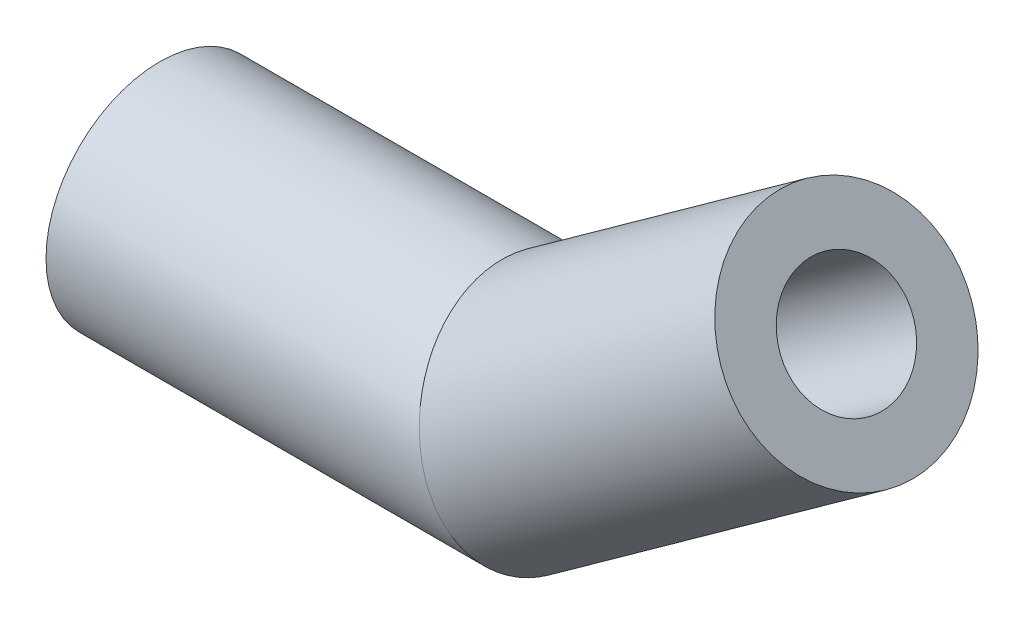
ISO-10303-21;
HEADER;
FILE_DESCRIPTION(('STEP AP214'),'2;1');
FILE_NAME('part.step','',(''),(''),'','','');
FILE_SCHEMA(('AUTOMOTIVE_DESIGN { 1 0 10303 214 1 1 1 1 }'));
ENDSEC;
DATA;
#1=APPLICATION_CONTEXT('core data for automotive mechanical design processes');
#2=APPLICATION_PROTOCOL_DEFINITION('international standard','automotive_design',2000,#1);
#3=PRODUCT_CONTEXT('',#1,'mechanical');
#4=PRODUCT('Part','Part','',(#3));
#5=PRODUCT_RELATED_PRODUCT_CATEGORY('part','',(#4));
#6=PRODUCT_DEFINITION_FORMATION('','',#4);
#7=PRODUCT_DEFINITION_CONTEXT('part definition',#1,'design');
#8=PRODUCT_DEFINITION('design','',#6,#7);
#9=PRODUCT_DEFINITION_SHAPE('','',#8);
#10=(LENGTH_UNIT() NAMED_UNIT(*) SI_UNIT(.MILLI.,.METRE.));
#11=(NAMED_UNIT(*) PLANE_ANGLE_UNIT() SI_UNIT($,.RADIAN.));
#12=(NAMED_UNIT(*) SI_UNIT($,.STERADIAN.) SOLID_ANGLE_UNIT());
#13=UNCERTAINTY_MEASURE_WITH_UNIT(LENGTH_MEASURE(1.E-05),#10,'distance_accuracy_value','');
#14=(GEOMETRIC_REPRESENTATION_CONTEXT(3) GLOBAL_UNCERTAINTY_ASSIGNED_CONTEXT((#13)) GLOBAL_UNIT_ASSIGNED_CONTEXT((#10,
#11,#12)) REPRESENTATION_CONTEXT('',''));
#15=CARTESIAN_POINT('',(0.,0.,0.));
#16=DIRECTION('',(0.,0.,1.));
#17=DIRECTION('',(1.,0.,0.));
#18=AXIS2_PLACEMENT_3D('',#15,#16,#17);
#19=CARTESIAN_POINT('',(18.1198166736899,5.83682937781013,0.));
#20=DIRECTION('',(-0.81198166736899,-0.583682937781013,0.));
#21=DIRECTION('',(0.583682937781013,-0.81198166736899,0.));
#22=AXIS2_PLACEMENT_3D('',#19,#20,#21);
#23=PLANE('',#22);
#24=CARTESIAN_POINT('',(18.1198166736899,5.83682937781013,0.));
#25=DIRECTION('',(0.811981667368991,0.583682937781013,0.));
#26=DIRECTION('',(0.,0.,-1.));
#27=AXIS2_PLACEMENT_3D('',#24,#25,#26);
#28=CIRCLE('',#27,1.6);
#29=CARTESIAN_POINT('',(18.1198166736899,5.83682937781013,-1.6));
#30=VERTEX_POINT('',#29);
#31=EDGE_CURVE('E65',#30,#30,#28,.T.);
#32=ORIENTED_EDGE('',*,*,#31,.F.);
#33=EDGE_LOOP('',(#32));
#34=FACE_BOUND('',#33,.T.);
#35=CARTESIAN_POINT('',(18.1198166736899,5.83682937781013,0.));
#36=DIRECTION('',(-0.81198166736899,-0.583682937781013,0.));
#37=DIRECTION('',(0.583682937781013,-0.81198166736899,0.));
#38=AXIS2_PLACEMENT_3D('',#35,#36,#37);
#39=CIRCLE('',#38,3.);
#40=CARTESIAN_POINT('',(19.8708654870329,3.40088437570316,0.));
#41=VERTEX_POINT('',#40);
#42=EDGE_CURVE('E48',#41,#41,#39,.T.);
#43=ORIENTED_EDGE('',*,*,#42,.F.);
#44=EDGE_LOOP('',(#43));
#45=FACE_BOUND('',#44,.T.);
#46=ADVANCED_FACE('F45',(#34,#45),#23,.F.);
#47=CARTESIAN_POINT('',(0.,0.,0.));
#48=DIRECTION('',(-1.,0.,0.));
#49=DIRECTION('',(0.,-1.,0.));
#50=AXIS2_PLACEMENT_3D('',#47,#48,#49);
#51=PLANE('',#50);
#52=CARTESIAN_POINT('',(0.,0.,0.));
#53=DIRECTION('',(1.,0.,0.));
#54=DIRECTION('',(0.,0.,-1.));
#55=AXIS2_PLACEMENT_3D('',#52,#53,#54);
#56=CIRCLE('',#55,1.6);
#57=CARTESIAN_POINT('',(0.,0.,-1.6));
#58=VERTEX_POINT('',#57);
#59=EDGE_CURVE('E58',#58,#58,#56,.T.);
#60=ORIENTED_EDGE('',*,*,#59,.T.);
#61=EDGE_LOOP('',(#60));
#62=FACE_BOUND('',#61,.T.);
#63=CARTESIAN_POINT('',(0.,0.,0.));
#64=DIRECTION('',(-1.,0.,0.));
#65=DIRECTION('',(0.,-1.,0.));
#66=AXIS2_PLACEMENT_3D('',#63,#64,#65);
#67=CIRCLE('',#66,3.);
#68=CARTESIAN_POINT('',(0.,-3.,0.));
#69=VERTEX_POINT('',#68);
#70=EDGE_CURVE('E52',#69,#69,#67,.T.);
#71=ORIENTED_EDGE('',*,*,#70,.T.);
#72=EDGE_LOOP('',(#71));
#73=FACE_BOUND('',#72,.T.);
#74=ADVANCED_FACE('F82',(#62,#73),#51,.T.);
#75=CARTESIAN_POINT('',(9.0556576211674,-0.678828791460432,0.));
#76=DIRECTION('',(0.811981667368991,0.583682937781013,0.));
#77=DIRECTION('',(-0.583682937781013,0.811981667368991,0.));
#78=AXIS2_PLACEMENT_3D('',#75,#76,#77);
#79=CYLINDRICAL_SURFACE('',#78,3.);
#80=CARTESIAN_POINT('',(10.,0.,0.));
#81=DIRECTION('',(0.951835507682129,0.306609142583036,0.));
#82=DIRECTION('',(0.306609142583036,-0.951835507682129,0.));
#83=AXIS2_PLACEMENT_3D('',#80,#81,#82);
#84=ELLIPSE('',#83,3.1518050921482,3.);
#85=CARTESIAN_POINT('',(10.9663722568924,-3.,0.));
#86=VERTEX_POINT('',#85);
#87=EDGE_CURVE('E11',#86,#86,#84,.T.);
#88=ORIENTED_EDGE('',*,*,#87,.T.);
#89=EDGE_LOOP('',(#88));
#90=FACE_BOUND('',#89,.T.);
#91=ORIENTED_EDGE('',*,*,#42,.T.);
#92=EDGE_LOOP('',(#91));
#93=FACE_BOUND('',#92,.T.);
#94=ADVANCED_FACE('F87',(#90,#93),#79,.T.);
#95=CARTESIAN_POINT('',(0.,0.,0.));
#96=DIRECTION('',(1.,0.,0.));
#97=DIRECTION('',(0.,0.,-1.));
#98=AXIS2_PLACEMENT_3D('',#95,#96,#97);
#99=CYLINDRICAL_SURFACE('',#98,3.);
#100=ORIENTED_EDGE('',*,*,#70,.F.);
#101=EDGE_LOOP('',(#100));
#102=FACE_BOUND('',#101,.T.);
#103=ORIENTED_EDGE('',*,*,#87,.F.);
#104=EDGE_LOOP('',(#103));
#105=FACE_BOUND('',#104,.T.);
#106=ADVANCED_FACE('F89',(#102,#105),#99,.T.);
#107=CARTESIAN_POINT('',(7.,0.,0.));
#108=DIRECTION('',(-1.,0.,0.));
#109=DIRECTION('',(0.,0.,1.));
#110=AXIS2_PLACEMENT_3D('',#107,#108,#109);
#111=CYLINDRICAL_SURFACE('',#110,1.6);
#112=CARTESIAN_POINT('',(7.,0.,0.));
#113=DIRECTION('',(1.,0.,0.));
#114=DIRECTION('',(0.,0.,-1.));
#115=AXIS2_PLACEMENT_3D('',#112,#113,#114);
#116=CIRCLE('',#115,1.6);
#117=CARTESIAN_POINT('',(7.,0.,-1.6));
#118=VERTEX_POINT('',#117);
#119=EDGE_CURVE('E61',#118,#118,#116,.T.);
#120=ORIENTED_EDGE('',*,*,#119,.T.);
#121=EDGE_LOOP('',(#120));
#122=FACE_BOUND('',#121,.T.);
#123=ORIENTED_EDGE('',*,*,#59,.F.);
#124=EDGE_LOOP('',(#123));
#125=FACE_BOUND('',#124,.T.);
#126=ADVANCED_FACE('F83',(#122,#125),#111,.F.);
#127=CARTESIAN_POINT('',(7.,0.,0.));
#128=DIRECTION('',(1.,0.,0.));
#129=DIRECTION('',(0.,0.,-1.));
#130=AXIS2_PLACEMENT_3D('',#127,#128,#129);
#131=PLANE('',#130);
#132=ORIENTED_EDGE('',*,*,#119,.F.);
#133=EDGE_LOOP('',(#132));
#134=FACE_BOUND('',#133,.T.);
#135=ADVANCED_FACE('F76',(#134),#131,.F.);
#136=CARTESIAN_POINT('',(12.435945002107,1.75104881334304,0.));
#137=DIRECTION('',(0.811981667368991,0.583682937781013,0.));
#138=DIRECTION('',(-0.583682937781013,0.811981667368991,0.));
#139=AXIS2_PLACEMENT_3D('',#136,#137,#138);
#140=CYLINDRICAL_SURFACE('',#139,1.6);
#141=CARTESIAN_POINT('',(12.435945002107,1.75104881334304,0.));
#142=DIRECTION('',(0.811981667368991,0.583682937781013,0.));
#143=DIRECTION('',(0.,0.,-1.));
#144=AXIS2_PLACEMENT_3D('',#141,#142,#143);
#145=CIRCLE('',#144,1.6);
#146=CARTESIAN_POINT('',(12.435945002107,1.75104881334304,-1.6));
#147=VERTEX_POINT('',#146);
#148=EDGE_CURVE('E62',#147,#147,#145,.T.);
#149=ORIENTED_EDGE('',*,*,#148,.F.);
#150=EDGE_LOOP('',(#149));
#151=FACE_BOUND('',#150,.T.);
#152=ORIENTED_EDGE('',*,*,#31,.T.);
#153=EDGE_LOOP('',(#152));
#154=FACE_BOUND('',#153,.T.);
#155=ADVANCED_FACE('F73',(#151,#154),#140,.F.);
#156=CARTESIAN_POINT('',(12.435945002107,1.75104881334304,0.));
#157=DIRECTION('',(-0.811981667368991,-0.583682937781013,0.));
#158=DIRECTION('',(0.,0.,-1.));
#159=AXIS2_PLACEMENT_3D('',#156,#157,#158);
#160=PLANE('',#159);
#161=ORIENTED_EDGE('',*,*,#148,.T.);
#162=EDGE_LOOP('',(#161));
#163=FACE_BOUND('',#162,.T.);
#164=ADVANCED_FACE('F71',(#163),#160,.F.);
#165=CLOSED_SHELL('',(#46,#74,#94,#106,#126,#135,#155,#164));
#166=MANIFOLD_SOLID_BREP('B2',#165);
#167=ADVANCED_BREP_SHAPE_REPRESENTATION('',(#18,#166),#14);
#168=SHAPE_DEFINITION_REPRESENTATION(#9,#167);
ENDSEC;
END-ISO-10303-21;
